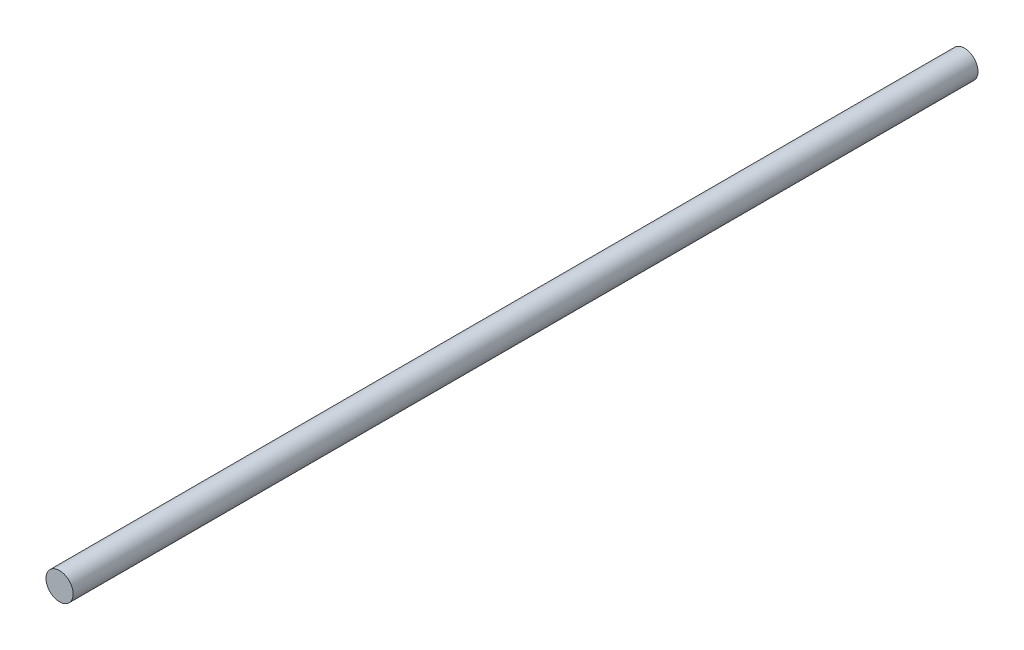
ISO-10303-21;
HEADER;
FILE_DESCRIPTION(('STEP AP214'),'2;1');
FILE_NAME('part.step','',(''),(''),'','','');
FILE_SCHEMA(('AUTOMOTIVE_DESIGN { 1 0 10303 214 1 1 1 1 }'));
ENDSEC;
DATA;
#1=APPLICATION_CONTEXT('core data for automotive mechanical design processes');
#2=APPLICATION_PROTOCOL_DEFINITION('international standard','automotive_design',2000,#1);
#3=PRODUCT_CONTEXT('',#1,'mechanical');
#4=PRODUCT('Part','Part','',(#3));
#5=PRODUCT_RELATED_PRODUCT_CATEGORY('part','',(#4));
#6=PRODUCT_DEFINITION_FORMATION('','',#4);
#7=PRODUCT_DEFINITION_CONTEXT('part definition',#1,'design');
#8=PRODUCT_DEFINITION('design','',#6,#7);
#9=PRODUCT_DEFINITION_SHAPE('','',#8);
#10=(LENGTH_UNIT() NAMED_UNIT(*) SI_UNIT(.MILLI.,.METRE.));
#11=(NAMED_UNIT(*) PLANE_ANGLE_UNIT() SI_UNIT($,.RADIAN.));
#12=(NAMED_UNIT(*) SI_UNIT($,.STERADIAN.) SOLID_ANGLE_UNIT());
#13=UNCERTAINTY_MEASURE_WITH_UNIT(LENGTH_MEASURE(1.E-05),#10,'distance_accuracy_value','');
#14=(GEOMETRIC_REPRESENTATION_CONTEXT(3) GLOBAL_UNCERTAINTY_ASSIGNED_CONTEXT((#13)) GLOBAL_UNIT_ASSIGNED_CONTEXT((#10,
#11,#12)) REPRESENTATION_CONTEXT('',''));
#15=CARTESIAN_POINT('',(0.,0.,0.));
#16=DIRECTION('',(0.,0.,1.));
#17=DIRECTION('',(1.,0.,0.));
#18=AXIS2_PLACEMENT_3D('',#15,#16,#17);
#19=CARTESIAN_POINT('',(0.,0.,100.));
#20=DIRECTION('',(0.,0.,-1.));
#21=DIRECTION('',(-1.,0.,0.));
#22=AXIS2_PLACEMENT_3D('',#19,#20,#21);
#23=CYLINDRICAL_SURFACE('',#22,1.5);
#24=CARTESIAN_POINT('',(0.,0.,100.));
#25=DIRECTION('',(0.,0.,1.));
#26=DIRECTION('',(1.,0.,0.));
#27=AXIS2_PLACEMENT_3D('',#24,#25,#26);
#28=CIRCLE('',#27,1.5);
#29=CARTESIAN_POINT('',(1.5,0.,100.));
#30=VERTEX_POINT('',#29);
#31=EDGE_CURVE('E10',#30,#30,#28,.T.);
#32=ORIENTED_EDGE('',*,*,#31,.F.);
#33=EDGE_LOOP('',(#32));
#34=FACE_BOUND('',#33,.T.);
#35=CARTESIAN_POINT('',(0.,0.,0.));
#36=DIRECTION('',(0.,0.,1.));
#37=DIRECTION('',(1.,0.,0.));
#38=AXIS2_PLACEMENT_3D('',#35,#36,#37);
#39=CIRCLE('',#38,1.5);
#40=CARTESIAN_POINT('',(1.5,0.,0.));
#41=VERTEX_POINT('',#40);
#42=EDGE_CURVE('E37',#41,#41,#39,.T.);
#43=ORIENTED_EDGE('',*,*,#42,.T.);
#44=EDGE_LOOP('',(#43));
#45=FACE_BOUND('',#44,.T.);
#46=ADVANCED_FACE('F34',(#34,#45),#23,.T.);
#47=CARTESIAN_POINT('',(0.,0.,100.));
#48=DIRECTION('',(0.,0.,1.));
#49=DIRECTION('',(1.,0.,0.));
#50=AXIS2_PLACEMENT_3D('',#47,#48,#49);
#51=PLANE('',#50);
#52=ORIENTED_EDGE('',*,*,#31,.T.);
#53=EDGE_LOOP('',(#52));
#54=FACE_BOUND('',#53,.T.);
#55=ADVANCED_FACE('F49',(#54),#51,.T.);
#56=CARTESIAN_POINT('',(0.,0.,0.));
#57=DIRECTION('',(0.,0.,1.));
#58=DIRECTION('',(1.,0.,0.));
#59=AXIS2_PLACEMENT_3D('',#56,#57,#58);
#60=PLANE('',#59);
#61=ORIENTED_EDGE('',*,*,#42,.F.);
#62=EDGE_LOOP('',(#61));
#63=FACE_BOUND('',#62,.T.);
#64=ADVANCED_FACE('F47',(#63),#60,.F.);
#65=CLOSED_SHELL('',(#46,#55,#64));
#66=MANIFOLD_SOLID_BREP('B2',#65);
#67=ADVANCED_BREP_SHAPE_REPRESENTATION('',(#18,#66),#14);
#68=SHAPE_DEFINITION_REPRESENTATION(#9,#67);
ENDSEC;
END-ISO-10303-21;
